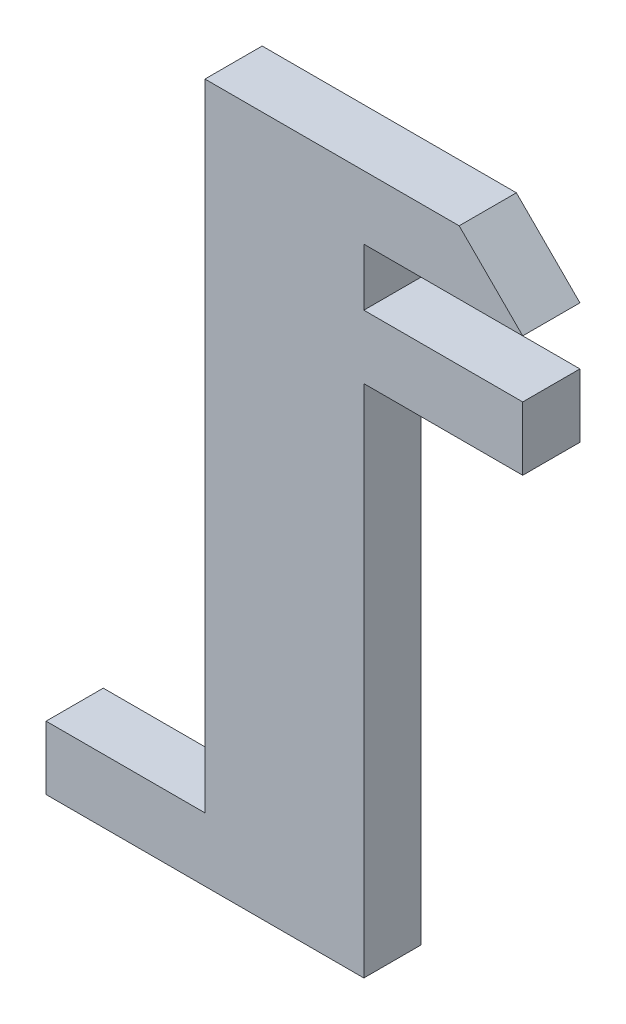
ISO-10303-21;
HEADER;
FILE_DESCRIPTION(('STEP AP214'),'2;1');
FILE_NAME('part.step','',(''),(''),'','','');
FILE_SCHEMA(('AUTOMOTIVE_DESIGN { 1 0 10303 214 1 1 1 1 }'));
ENDSEC;
DATA;
#1=APPLICATION_CONTEXT('core data for automotive mechanical design processes');
#2=APPLICATION_PROTOCOL_DEFINITION('international standard','automotive_design',2000,#1);
#3=PRODUCT_CONTEXT('',#1,'mechanical');
#4=PRODUCT('Part','Part','',(#3));
#5=PRODUCT_RELATED_PRODUCT_CATEGORY('part','',(#4));
#6=PRODUCT_DEFINITION_FORMATION('','',#4);
#7=PRODUCT_DEFINITION_CONTEXT('part definition',#1,'design');
#8=PRODUCT_DEFINITION('design','',#6,#7);
#9=PRODUCT_DEFINITION_SHAPE('','',#8);
#10=(LENGTH_UNIT() NAMED_UNIT(*) SI_UNIT(.MILLI.,.METRE.));
#11=(NAMED_UNIT(*) PLANE_ANGLE_UNIT() SI_UNIT($,.RADIAN.));
#12=(NAMED_UNIT(*) SI_UNIT($,.STERADIAN.) SOLID_ANGLE_UNIT());
#13=UNCERTAINTY_MEASURE_WITH_UNIT(LENGTH_MEASURE(1.E-05),#10,'distance_accuracy_value','');
#14=(GEOMETRIC_REPRESENTATION_CONTEXT(3) GLOBAL_UNCERTAINTY_ASSIGNED_CONTEXT((#13)) GLOBAL_UNIT_ASSIGNED_CONTEXT((#10,
#11,#12)) REPRESENTATION_CONTEXT('',''));
#15=CARTESIAN_POINT('',(0.,0.,0.));
#16=DIRECTION('',(0.,0.,1.));
#17=DIRECTION('',(1.,0.,0.));
#18=AXIS2_PLACEMENT_3D('',#15,#16,#17);
#19=CARTESIAN_POINT('',(0.,10.,9.));
#20=DIRECTION('',(1.,0.,0.));
#21=DIRECTION('',(0.,1.,0.));
#22=AXIS2_PLACEMENT_3D('',#19,#20,#21);
#23=PLANE('',#22);
#24=DIRECTION('',(0.,-1.,0.));
#25=VECTOR('',#24,1.);
#26=CARTESIAN_POINT('',(0.,10.,0.));
#27=LINE('',#26,#25);
#28=CARTESIAN_POINT('',(0.,10.,0.));
#29=VERTEX_POINT('',#28);
#30=CARTESIAN_POINT('',(0.,0.,0.));
#31=VERTEX_POINT('',#30);
#32=EDGE_CURVE('E142',#29,#31,#27,.T.);
#33=ORIENTED_EDGE('',*,*,#32,.T.);
#34=DIRECTION('',(0.,0.,-1.));
#35=VECTOR('',#34,1.);
#36=CARTESIAN_POINT('',(0.,0.,9.));
#37=LINE('',#36,#35);
#38=CARTESIAN_POINT('',(0.,0.,9.));
#39=VERTEX_POINT('',#38);
#40=EDGE_CURVE('E124',#39,#31,#37,.T.);
#41=ORIENTED_EDGE('',*,*,#40,.F.);
#42=DIRECTION('',(0.,-1.,0.));
#43=VECTOR('',#42,1.);
#44=CARTESIAN_POINT('',(0.,10.,9.));
#45=LINE('',#44,#43);
#46=CARTESIAN_POINT('',(0.,10.,9.));
#47=VERTEX_POINT('',#46);
#48=EDGE_CURVE('E130',#47,#39,#45,.T.);
#49=ORIENTED_EDGE('',*,*,#48,.F.);
#50=DIRECTION('',(0.,0.,-1.));
#51=VECTOR('',#50,1.);
#52=CARTESIAN_POINT('',(0.,10.,9.));
#53=LINE('',#52,#51);
#54=EDGE_CURVE('E212',#47,#29,#53,.T.);
#55=ORIENTED_EDGE('',*,*,#54,.T.);
#56=EDGE_LOOP('',(#33,#41,#49,#55));
#57=FACE_BOUND('',#56,.T.);
#58=ADVANCED_FACE('F33',(#57),#23,.F.);
#59=CARTESIAN_POINT('',(0.,0.,9.));
#60=DIRECTION('',(0.,1.,0.));
#61=DIRECTION('',(0.,0.,1.));
#62=AXIS2_PLACEMENT_3D('',#59,#60,#61);
#63=PLANE('',#62);
#64=DIRECTION('',(1.,0.,0.));
#65=VECTOR('',#64,1.);
#66=CARTESIAN_POINT('',(0.,0.,0.));
#67=LINE('',#66,#65);
#68=CARTESIAN_POINT('',(50.,0.,0.));
#69=VERTEX_POINT('',#68);
#70=EDGE_CURVE('E202',#31,#69,#67,.T.);
#71=ORIENTED_EDGE('',*,*,#70,.T.);
#72=DIRECTION('',(0.,0.,-1.));
#73=VECTOR('',#72,1.);
#74=CARTESIAN_POINT('',(50.,0.,9.));
#75=LINE('',#74,#73);
#76=CARTESIAN_POINT('',(50.,0.,9.));
#77=VERTEX_POINT('',#76);
#78=EDGE_CURVE('E127',#77,#69,#75,.T.);
#79=ORIENTED_EDGE('',*,*,#78,.F.);
#80=DIRECTION('',(1.,0.,0.));
#81=VECTOR('',#80,1.);
#82=CARTESIAN_POINT('',(0.,0.,9.));
#83=LINE('',#82,#81);
#84=EDGE_CURVE('E120',#39,#77,#83,.T.);
#85=ORIENTED_EDGE('',*,*,#84,.F.);
#86=ORIENTED_EDGE('',*,*,#40,.T.);
#87=EDGE_LOOP('',(#71,#79,#85,#86));
#88=FACE_BOUND('',#87,.T.);
#89=ADVANCED_FACE('F122',(#88),#63,.F.);
#90=CARTESIAN_POINT('',(50.,0.,9.));
#91=DIRECTION('',(-1.,0.,0.));
#92=DIRECTION('',(0.,-1.,0.));
#93=AXIS2_PLACEMENT_3D('',#90,#91,#92);
#94=PLANE('',#93);
#95=DIRECTION('',(0.,1.,0.));
#96=VECTOR('',#95,1.);
#97=CARTESIAN_POINT('',(50.,0.,0.));
#98=LINE('',#97,#96);
#99=CARTESIAN_POINT('',(50.,81.,0.));
#100=VERTEX_POINT('',#99);
#101=EDGE_CURVE('E196',#69,#100,#98,.T.);
#102=ORIENTED_EDGE('',*,*,#101,.T.);
#103=DIRECTION('',(0.,0.,-1.));
#104=VECTOR('',#103,1.);
#105=CARTESIAN_POINT('',(50.,81.,9.));
#106=LINE('',#105,#104);
#107=CARTESIAN_POINT('',(50.,81.,9.));
#108=VERTEX_POINT('',#107);
#109=EDGE_CURVE('E146',#108,#100,#106,.T.);
#110=ORIENTED_EDGE('',*,*,#109,.F.);
#111=DIRECTION('',(0.,1.,0.));
#112=VECTOR('',#111,1.);
#113=CARTESIAN_POINT('',(50.,0.,9.));
#114=LINE('',#113,#112);
#115=EDGE_CURVE('E129',#77,#108,#114,.T.);
#116=ORIENTED_EDGE('',*,*,#115,.F.);
#117=ORIENTED_EDGE('',*,*,#78,.T.);
#118=EDGE_LOOP('',(#102,#110,#116,#117));
#119=FACE_BOUND('',#118,.T.);
#120=ADVANCED_FACE('F236',(#119),#94,.F.);
#121=CARTESIAN_POINT('',(75.,81.,9.));
#122=DIRECTION('',(0.,1.,0.));
#123=DIRECTION('',(0.,0.,1.));
#124=AXIS2_PLACEMENT_3D('',#121,#122,#123);
#125=PLANE('',#124);
#126=DIRECTION('',(1.,0.,0.));
#127=VECTOR('',#126,1.);
#128=CARTESIAN_POINT('',(75.,81.,0.));
#129=LINE('',#128,#127);
#130=CARTESIAN_POINT('',(75.,81.,0.));
#131=VERTEX_POINT('',#130);
#132=EDGE_CURVE('E191',#100,#131,#129,.T.);
#133=ORIENTED_EDGE('',*,*,#132,.T.);
#134=DIRECTION('',(0.,0.,-1.));
#135=VECTOR('',#134,1.);
#136=CARTESIAN_POINT('',(75.,81.,9.));
#137=LINE('',#136,#135);
#138=CARTESIAN_POINT('',(75.,81.,9.));
#139=VERTEX_POINT('',#138);
#140=EDGE_CURVE('E182',#139,#131,#137,.T.);
#141=ORIENTED_EDGE('',*,*,#140,.F.);
#142=DIRECTION('',(1.,0.,0.));
#143=VECTOR('',#142,1.);
#144=CARTESIAN_POINT('',(75.,81.,9.));
#145=LINE('',#144,#143);
#146=EDGE_CURVE('E192',#108,#139,#145,.T.);
#147=ORIENTED_EDGE('',*,*,#146,.F.);
#148=ORIENTED_EDGE('',*,*,#109,.T.);
#149=EDGE_LOOP('',(#133,#141,#147,#148));
#150=FACE_BOUND('',#149,.T.);
#151=ADVANCED_FACE('F189',(#150),#125,.F.);
#152=CARTESIAN_POINT('',(75.,91.,9.));
#153=DIRECTION('',(-1.,0.,0.));
#154=DIRECTION('',(0.,-1.,0.));
#155=AXIS2_PLACEMENT_3D('',#152,#153,#154);
#156=PLANE('',#155);
#157=DIRECTION('',(0.,1.,0.));
#158=VECTOR('',#157,1.);
#159=CARTESIAN_POINT('',(75.,91.,0.));
#160=LINE('',#159,#158);
#161=CARTESIAN_POINT('',(75.,91.,0.));
#162=VERTEX_POINT('',#161);
#163=EDGE_CURVE('E198',#131,#162,#160,.T.);
#164=ORIENTED_EDGE('',*,*,#163,.T.);
#165=DIRECTION('',(0.,0.,-1.));
#166=VECTOR('',#165,1.);
#167=CARTESIAN_POINT('',(75.,91.,9.));
#168=LINE('',#167,#166);
#169=CARTESIAN_POINT('',(75.,91.,9.));
#170=VERTEX_POINT('',#169);
#171=EDGE_CURVE('E179',#170,#162,#168,.T.);
#172=ORIENTED_EDGE('',*,*,#171,.F.);
#173=DIRECTION('',(0.,1.,0.));
#174=VECTOR('',#173,1.);
#175=CARTESIAN_POINT('',(75.,91.,9.));
#176=LINE('',#175,#174);
#177=EDGE_CURVE('E233',#139,#170,#176,.T.);
#178=ORIENTED_EDGE('',*,*,#177,.F.);
#179=ORIENTED_EDGE('',*,*,#140,.T.);
#180=EDGE_LOOP('',(#164,#172,#178,#179));
#181=FACE_BOUND('',#180,.T.);
#182=ADVANCED_FACE('F243',(#181),#156,.F.);
#183=CARTESIAN_POINT('',(50.,91.,9.));
#184=DIRECTION('',(0.,-1.,0.));
#185=DIRECTION('',(1.,0.,0.));
#186=AXIS2_PLACEMENT_3D('',#183,#184,#185);
#187=PLANE('',#186);
#188=DIRECTION('',(-1.,0.,0.));
#189=VECTOR('',#188,1.);
#190=CARTESIAN_POINT('',(50.,91.,0.));
#191=LINE('',#190,#189);
#192=CARTESIAN_POINT('',(50.,91.,0.));
#193=VERTEX_POINT('',#192);
#194=EDGE_CURVE('E200',#162,#193,#191,.T.);
#195=ORIENTED_EDGE('',*,*,#194,.T.);
#196=DIRECTION('',(0.,0.,-1.));
#197=VECTOR('',#196,1.);
#198=CARTESIAN_POINT('',(50.,91.,9.));
#199=LINE('',#198,#197);
#200=CARTESIAN_POINT('',(50.,91.,9.));
#201=VERTEX_POINT('',#200);
#202=EDGE_CURVE('E170',#201,#193,#199,.T.);
#203=ORIENTED_EDGE('',*,*,#202,.F.);
#204=DIRECTION('',(-1.,0.,0.));
#205=VECTOR('',#204,1.);
#206=CARTESIAN_POINT('',(50.,91.,9.));
#207=LINE('',#206,#205);
#208=EDGE_CURVE('E231',#170,#201,#207,.T.);
#209=ORIENTED_EDGE('',*,*,#208,.F.);
#210=ORIENTED_EDGE('',*,*,#171,.T.);
#211=EDGE_LOOP('',(#195,#203,#209,#210));
#212=FACE_BOUND('',#211,.T.);
#213=ADVANCED_FACE('F272',(#212),#187,.F.);
#214=CARTESIAN_POINT('',(50.,91.,9.));
#215=DIRECTION('',(-1.,0.,0.));
#216=DIRECTION('',(0.,0.,1.));
#217=AXIS2_PLACEMENT_3D('',#214,#215,#216);
#218=PLANE('',#217);
#219=DIRECTION('',(0.,1.,0.));
#220=VECTOR('',#219,1.);
#221=CARTESIAN_POINT('',(50.,91.,0.));
#222=LINE('',#221,#220);
#223=CARTESIAN_POINT('',(50.,100.,0.));
#224=VERTEX_POINT('',#223);
#225=EDGE_CURVE('E166',#193,#224,#222,.T.);
#226=ORIENTED_EDGE('',*,*,#225,.T.);
#227=DIRECTION('',(0.,0.,-1.));
#228=VECTOR('',#227,1.);
#229=CARTESIAN_POINT('',(50.,100.,9.));
#230=LINE('',#229,#228);
#231=CARTESIAN_POINT('',(50.,100.,9.));
#232=VERTEX_POINT('',#231);
#233=EDGE_CURVE('E165',#232,#224,#230,.T.);
#234=ORIENTED_EDGE('',*,*,#233,.F.);
#235=DIRECTION('',(0.,1.,0.));
#236=VECTOR('',#235,1.);
#237=CARTESIAN_POINT('',(50.,91.,9.));
#238=LINE('',#237,#236);
#239=EDGE_CURVE('E229',#201,#232,#238,.T.);
#240=ORIENTED_EDGE('',*,*,#239,.F.);
#241=ORIENTED_EDGE('',*,*,#202,.T.);
#242=EDGE_LOOP('',(#226,#234,#240,#241));
#243=FACE_BOUND('',#242,.T.);
#244=ADVANCED_FACE('F282',(#243),#218,.F.);
#245=CARTESIAN_POINT('',(50.,100.,9.));
#246=DIRECTION('',(0.,1.,0.));
#247=DIRECTION('',(-1.,0.,0.));
#248=AXIS2_PLACEMENT_3D('',#245,#246,#247);
#249=PLANE('',#248);
#250=DIRECTION('',(1.,0.,0.));
#251=VECTOR('',#250,1.);
#252=CARTESIAN_POINT('',(50.,100.,0.));
#253=LINE('',#252,#251);
#254=CARTESIAN_POINT('',(75.,100.,0.));
#255=VERTEX_POINT('',#254);
#256=EDGE_CURVE('E155',#224,#255,#253,.T.);
#257=ORIENTED_EDGE('',*,*,#256,.T.);
#258=DIRECTION('',(0.,0.,-1.));
#259=VECTOR('',#258,1.);
#260=CARTESIAN_POINT('',(75.,100.,9.));
#261=LINE('',#260,#259);
#262=CARTESIAN_POINT('',(75.,100.,9.));
#263=VERTEX_POINT('',#262);
#264=EDGE_CURVE('E163',#263,#255,#261,.T.);
#265=ORIENTED_EDGE('',*,*,#264,.F.);
#266=DIRECTION('',(1.,0.,0.));
#267=VECTOR('',#266,1.);
#268=CARTESIAN_POINT('',(50.,100.,9.));
#269=LINE('',#268,#267);
#270=EDGE_CURVE('E227',#232,#263,#269,.T.);
#271=ORIENTED_EDGE('',*,*,#270,.F.);
#272=ORIENTED_EDGE('',*,*,#233,.T.);
#273=EDGE_LOOP('',(#257,#265,#271,#272));
#274=FACE_BOUND('',#273,.T.);
#275=ADVANCED_FACE('F161',(#274),#249,.F.);
#276=CARTESIAN_POINT('',(75.,110.,9.));
#277=DIRECTION('',(0.,-1.,0.));
#278=DIRECTION('',(1.,0.,0.));
#279=AXIS2_PLACEMENT_3D('',#276,#277,#278);
#280=PLANE('',#279);
#281=DIRECTION('',(-1.,0.,0.));
#282=VECTOR('',#281,1.);
#283=CARTESIAN_POINT('',(75.,110.,9.));
#284=LINE('',#283,#282);
#285=CARTESIAN_POINT('',(65.,110.,9.));
#286=VERTEX_POINT('',#285);
#287=CARTESIAN_POINT('',(25.,110.,9.));
#288=VERTEX_POINT('',#287);
#289=EDGE_CURVE('E225',#286,#288,#284,.T.);
#290=ORIENTED_EDGE('',*,*,#289,.F.);
#291=DIRECTION('',(0.,0.,-1.));
#292=VECTOR('',#291,1.);
#293=CARTESIAN_POINT('',(65.,110.,9.));
#294=LINE('',#293,#292);
#295=CARTESIAN_POINT('',(65.,110.,0.));
#296=VERTEX_POINT('',#295);
#297=EDGE_CURVE('E143',#286,#296,#294,.T.);
#298=ORIENTED_EDGE('',*,*,#297,.T.);
#299=DIRECTION('',(-1.,0.,0.));
#300=VECTOR('',#299,1.);
#301=CARTESIAN_POINT('',(75.,110.,0.));
#302=LINE('',#301,#300);
#303=CARTESIAN_POINT('',(25.,110.,0.));
#304=VERTEX_POINT('',#303);
#305=EDGE_CURVE('E157',#296,#304,#302,.T.);
#306=ORIENTED_EDGE('',*,*,#305,.T.);
#307=DIRECTION('',(0.,0.,-1.));
#308=VECTOR('',#307,1.);
#309=CARTESIAN_POINT('',(25.,110.,9.));
#310=LINE('',#309,#308);
#311=EDGE_CURVE('E168',#288,#304,#310,.T.);
#312=ORIENTED_EDGE('',*,*,#311,.F.);
#313=EDGE_LOOP('',(#290,#298,#306,#312));
#314=FACE_BOUND('',#313,.T.);
#315=ADVANCED_FACE('F304',(#314),#280,.F.);
#316=CARTESIAN_POINT('',(25.,110.,9.));
#317=DIRECTION('',(1.,0.,0.));
#318=DIRECTION('',(0.,1.,0.));
#319=AXIS2_PLACEMENT_3D('',#316,#317,#318);
#320=PLANE('',#319);
#321=DIRECTION('',(0.,-1.,0.));
#322=VECTOR('',#321,1.);
#323=CARTESIAN_POINT('',(25.,110.,0.));
#324=LINE('',#323,#322);
#325=CARTESIAN_POINT('',(25.,10.,0.));
#326=VERTEX_POINT('',#325);
#327=EDGE_CURVE('E209',#304,#326,#324,.T.);
#328=ORIENTED_EDGE('',*,*,#327,.T.);
#329=DIRECTION('',(0.,0.,-1.));
#330=VECTOR('',#329,1.);
#331=CARTESIAN_POINT('',(25.,10.,9.));
#332=LINE('',#331,#330);
#333=CARTESIAN_POINT('',(25.,10.,9.));
#334=VERTEX_POINT('',#333);
#335=EDGE_CURVE('E173',#334,#326,#332,.T.);
#336=ORIENTED_EDGE('',*,*,#335,.F.);
#337=DIRECTION('',(0.,-1.,0.));
#338=VECTOR('',#337,1.);
#339=CARTESIAN_POINT('',(25.,110.,9.));
#340=LINE('',#339,#338);
#341=EDGE_CURVE('E223',#288,#334,#340,.T.);
#342=ORIENTED_EDGE('',*,*,#341,.F.);
#343=ORIENTED_EDGE('',*,*,#311,.T.);
#344=EDGE_LOOP('',(#328,#336,#342,#343));
#345=FACE_BOUND('',#344,.T.);
#346=ADVANCED_FACE('F299',(#345),#320,.F.);
#347=CARTESIAN_POINT('',(25.,10.,9.));
#348=DIRECTION('',(0.,-1.,0.));
#349=DIRECTION('',(0.,0.,-1.));
#350=AXIS2_PLACEMENT_3D('',#347,#348,#349);
#351=PLANE('',#350);
#352=DIRECTION('',(-1.,0.,0.));
#353=VECTOR('',#352,1.);
#354=CARTESIAN_POINT('',(25.,10.,0.));
#355=LINE('',#354,#353);
#356=EDGE_CURVE('E139',#326,#29,#355,.T.);
#357=ORIENTED_EDGE('',*,*,#356,.T.);
#358=ORIENTED_EDGE('',*,*,#54,.F.);
#359=DIRECTION('',(-1.,0.,0.));
#360=VECTOR('',#359,1.);
#361=CARTESIAN_POINT('',(25.,10.,9.));
#362=LINE('',#361,#360);
#363=EDGE_CURVE('E135',#334,#47,#362,.T.);
#364=ORIENTED_EDGE('',*,*,#363,.F.);
#365=ORIENTED_EDGE('',*,*,#335,.T.);
#366=EDGE_LOOP('',(#357,#358,#364,#365));
#367=FACE_BOUND('',#366,.T.);
#368=ADVANCED_FACE('F217',(#367),#351,.F.);
#369=CARTESIAN_POINT('',(0.,0.,9.));
#370=DIRECTION('',(0.,0.,1.));
#371=DIRECTION('',(1.,0.,0.));
#372=AXIS2_PLACEMENT_3D('',#369,#370,#371);
#373=PLANE('',#372);
#374=ORIENTED_EDGE('',*,*,#270,.T.);
#375=DIRECTION('',(0.707106781186546,-0.707106781186549,0.));
#376=VECTOR('',#375,1.);
#377=CARTESIAN_POINT('',(87.5000000000001,87.4999999999998,9.));
#378=LINE('',#377,#376);
#379=EDGE_CURVE('E11',#263,#286,#378,.F.);
#380=ORIENTED_EDGE('',*,*,#379,.T.);
#381=ORIENTED_EDGE('',*,*,#289,.T.);
#382=ORIENTED_EDGE('',*,*,#341,.T.);
#383=ORIENTED_EDGE('',*,*,#363,.T.);
#384=ORIENTED_EDGE('',*,*,#48,.T.);
#385=ORIENTED_EDGE('',*,*,#84,.T.);
#386=ORIENTED_EDGE('',*,*,#115,.T.);
#387=ORIENTED_EDGE('',*,*,#146,.T.);
#388=ORIENTED_EDGE('',*,*,#177,.T.);
#389=ORIENTED_EDGE('',*,*,#208,.T.);
#390=ORIENTED_EDGE('',*,*,#239,.T.);
#391=EDGE_LOOP('',(#374,#380,#381,#382,#383,#384,#385,#386,#387,#388,#389,#390));
#392=FACE_BOUND('',#391,.T.);
#393=ADVANCED_FACE('F133',(#392),#373,.T.);
#394=CARTESIAN_POINT('',(0.,0.,0.));
#395=DIRECTION('',(0.,0.,1.));
#396=DIRECTION('',(1.,0.,0.));
#397=AXIS2_PLACEMENT_3D('',#394,#395,#396);
#398=PLANE('',#397);
#399=ORIENTED_EDGE('',*,*,#305,.F.);
#400=DIRECTION('',(-0.707106781186546,0.707106781186549,0.));
#401=VECTOR('',#400,1.);
#402=CARTESIAN_POINT('',(65.,110.,0.));
#403=LINE('',#402,#401);
#404=EDGE_CURVE('E41',#296,#255,#403,.F.);
#405=ORIENTED_EDGE('',*,*,#404,.T.);
#406=ORIENTED_EDGE('',*,*,#256,.F.);
#407=ORIENTED_EDGE('',*,*,#225,.F.);
#408=ORIENTED_EDGE('',*,*,#194,.F.);
#409=ORIENTED_EDGE('',*,*,#163,.F.);
#410=ORIENTED_EDGE('',*,*,#132,.F.);
#411=ORIENTED_EDGE('',*,*,#101,.F.);
#412=ORIENTED_EDGE('',*,*,#70,.F.);
#413=ORIENTED_EDGE('',*,*,#32,.F.);
#414=ORIENTED_EDGE('',*,*,#356,.F.);
#415=ORIENTED_EDGE('',*,*,#327,.F.);
#416=EDGE_LOOP('',(#399,#405,#406,#407,#408,#409,#410,#411,#412,#413,#414,#415));
#417=FACE_BOUND('',#416,.T.);
#418=ADVANCED_FACE('F153',(#417),#398,.F.);
#419=CARTESIAN_POINT('',(65.,110.,9.));
#420=DIRECTION('',(-0.707106781186549,-0.707106781186546,0.));
#421=DIRECTION('',(0.,0.,-1.));
#422=AXIS2_PLACEMENT_3D('',#419,#420,#421);
#423=PLANE('',#422);
#424=ORIENTED_EDGE('',*,*,#379,.F.);
#425=ORIENTED_EDGE('',*,*,#264,.T.);
#426=ORIENTED_EDGE('',*,*,#404,.F.);
#427=ORIENTED_EDGE('',*,*,#297,.F.);
#428=EDGE_LOOP('',(#424,#425,#426,#427));
#429=FACE_BOUND('',#428,.T.);
#430=ADVANCED_FACE('F35',(#429),#423,.F.);
#431=CLOSED_SHELL('',(#58,#89,#120,#151,#182,#213,#244,#275,#315,#346,#368,#393,#418,#430));
#432=MANIFOLD_SOLID_BREP('B2',#431);
#433=ADVANCED_BREP_SHAPE_REPRESENTATION('',(#18,#432),#14);
#434=SHAPE_DEFINITION_REPRESENTATION(#9,#433);
ENDSEC;
END-ISO-10303-21;
